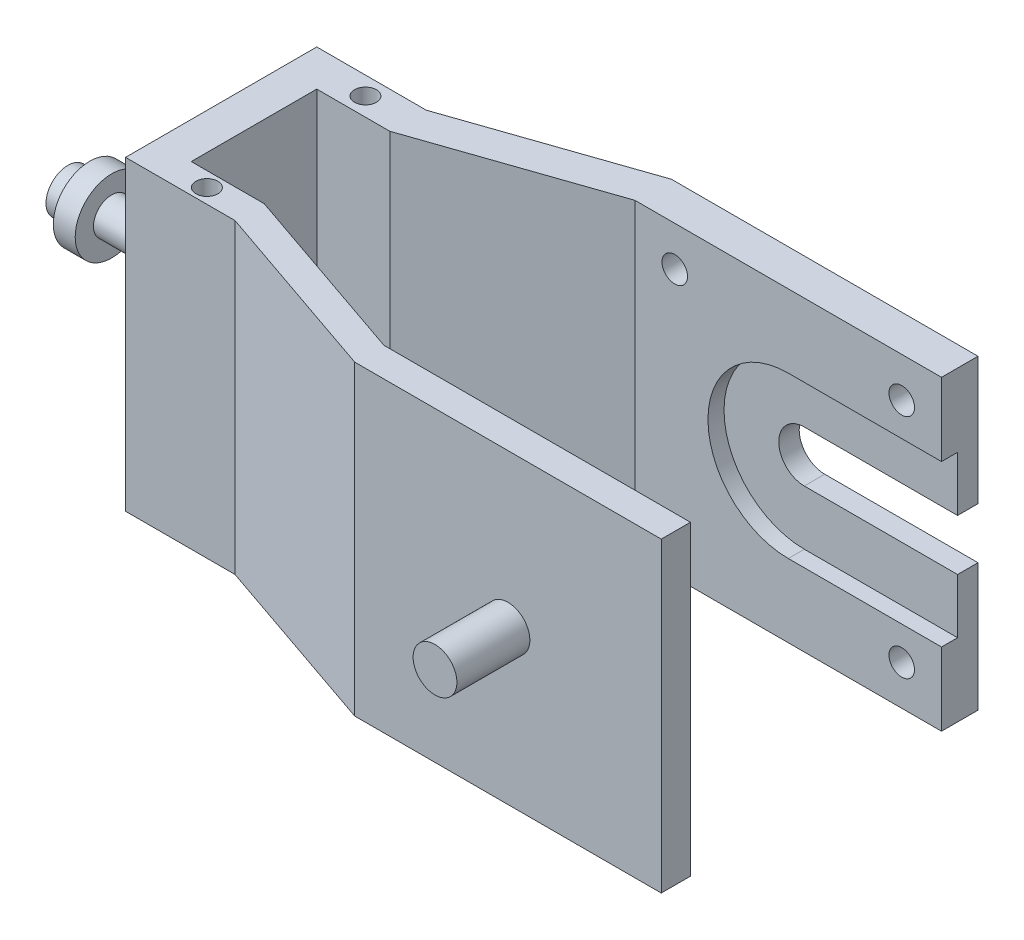
ISO-10303-21;
HEADER;
FILE_DESCRIPTION(('STEP AP214'),'2;1');
FILE_NAME('part.step','',(''),(''),'','','');
FILE_SCHEMA(('AUTOMOTIVE_DESIGN { 1 0 10303 214 1 1 1 1 }'));
ENDSEC;
DATA;
#1=APPLICATION_CONTEXT('core data for automotive mechanical design processes');
#2=APPLICATION_PROTOCOL_DEFINITION('international standard','automotive_design',2000,#1);
#3=PRODUCT_CONTEXT('',#1,'mechanical');
#4=PRODUCT('Part','Part','',(#3));
#5=PRODUCT_RELATED_PRODUCT_CATEGORY('part','',(#4));
#6=PRODUCT_DEFINITION_FORMATION('','',#4);
#7=PRODUCT_DEFINITION_CONTEXT('part definition',#1,'design');
#8=PRODUCT_DEFINITION('design','',#6,#7);
#9=PRODUCT_DEFINITION_SHAPE('','',#8);
#10=(LENGTH_UNIT() NAMED_UNIT(*) SI_UNIT(.MILLI.,.METRE.));
#11=(NAMED_UNIT(*) PLANE_ANGLE_UNIT() SI_UNIT($,.RADIAN.));
#12=(NAMED_UNIT(*) SI_UNIT($,.STERADIAN.) SOLID_ANGLE_UNIT());
#13=UNCERTAINTY_MEASURE_WITH_UNIT(LENGTH_MEASURE(1.E-05),#10,'distance_accuracy_value','');
#14=(GEOMETRIC_REPRESENTATION_CONTEXT(3) GLOBAL_UNCERTAINTY_ASSIGNED_CONTEXT((#13)) GLOBAL_UNIT_ASSIGNED_CONTEXT((#10,
#11,#12)) REPRESENTATION_CONTEXT('',''));
#15=CARTESIAN_POINT('',(0.,0.,0.));
#16=DIRECTION('',(0.,0.,1.));
#17=DIRECTION('',(1.,0.,0.));
#18=AXIS2_PLACEMENT_3D('',#15,#16,#17);
#19=CARTESIAN_POINT('',(0.,42.,-17.2));
#20=DIRECTION('',(-1.,0.,0.));
#21=DIRECTION('',(0.,0.,1.));
#22=AXIS2_PLACEMENT_3D('',#19,#20,#21);
#23=PLANE('',#22);
#24=DIRECTION('',(0.,1.,0.));
#25=VECTOR('',#24,1.);
#26=CARTESIAN_POINT('',(0.,10.,-19.4));
#27=LINE('',#26,#25);
#28=CARTESIAN_POINT('',(0.,24.5,-19.4));
#29=VERTEX_POINT('',#28);
#30=CARTESIAN_POINT('',(0.,32.,-19.4));
#31=VERTEX_POINT('',#30);
#32=EDGE_CURVE('E454',#29,#31,#27,.T.);
#33=ORIENTED_EDGE('',*,*,#32,.F.);
#34=DIRECTION('',(0.,0.,1.));
#35=VECTOR('',#34,1.);
#36=CARTESIAN_POINT('',(0.,24.5,-47.6803846124818));
#37=LINE('',#36,#35);
#38=CARTESIAN_POINT('',(0.,24.5,-22.2));
#39=VERTEX_POINT('',#38);
#40=EDGE_CURVE('E211',#39,#29,#37,.T.);
#41=ORIENTED_EDGE('',*,*,#40,.F.);
#42=DIRECTION('',(0.,-1.,0.));
#43=VECTOR('',#42,1.);
#44=CARTESIAN_POINT('',(0.,42.,-22.2));
#45=LINE('',#44,#43);
#46=CARTESIAN_POINT('',(0.,42.,-22.2));
#47=VERTEX_POINT('',#46);
#48=EDGE_CURVE('E228',#47,#39,#45,.T.);
#49=ORIENTED_EDGE('',*,*,#48,.F.);
#50=DIRECTION('',(0.,0.,-1.));
#51=VECTOR('',#50,1.);
#52=CARTESIAN_POINT('',(0.,42.,-17.2));
#53=LINE('',#52,#51);
#54=CARTESIAN_POINT('',(0.,42.,-17.2));
#55=VERTEX_POINT('',#54);
#56=EDGE_CURVE('E400',#55,#47,#53,.T.);
#57=ORIENTED_EDGE('',*,*,#56,.F.);
#58=DIRECTION('',(0.,-1.,0.));
#59=VECTOR('',#58,1.);
#60=CARTESIAN_POINT('',(0.,42.,-17.2));
#61=LINE('',#60,#59);
#62=CARTESIAN_POINT('',(0.,32.,-17.2));
#63=VERTEX_POINT('',#62);
#64=EDGE_CURVE('E235',#55,#63,#61,.T.);
#65=ORIENTED_EDGE('',*,*,#64,.T.);
#66=DIRECTION('',(0.,0.,1.));
#67=VECTOR('',#66,1.);
#68=CARTESIAN_POINT('',(0.,32.,-19.4));
#69=LINE('',#68,#67);
#70=EDGE_CURVE('E466',#31,#63,#69,.T.);
#71=ORIENTED_EDGE('',*,*,#70,.F.);
#72=EDGE_LOOP('',(#33,#41,#49,#57,#65,#71));
#73=FACE_BOUND('',#72,.T.);
#74=ADVANCED_FACE('F40',(#73),#23,.F.);
#75=CARTESIAN_POINT('',(0.,42.,-17.2));
#76=DIRECTION('',(0.,0.,1.));
#77=DIRECTION('',(1.,0.,0.));
#78=AXIS2_PLACEMENT_3D('',#75,#76,#77);
#79=PLANE('',#78);
#80=CARTESIAN_POINT('',(-5.45,5.45,-17.2));
#81=DIRECTION('',(0.,0.,1.));
#82=DIRECTION('',(1.,0.,0.));
#83=AXIS2_PLACEMENT_3D('',#80,#81,#82);
#84=CIRCLE('',#83,1.75);
#85=CARTESIAN_POINT('',(-3.7,5.45,-17.2));
#86=VERTEX_POINT('',#85);
#87=EDGE_CURVE('E562',#86,#86,#84,.F.);
#88=ORIENTED_EDGE('',*,*,#87,.T.);
#89=EDGE_LOOP('',(#88));
#90=FACE_BOUND('',#89,.T.);
#91=CARTESIAN_POINT('',(-36.55,36.55,-17.2));
#92=DIRECTION('',(0.,0.,1.));
#93=DIRECTION('',(1.,0.,0.));
#94=AXIS2_PLACEMENT_3D('',#91,#92,#93);
#95=CIRCLE('',#94,1.75);
#96=CARTESIAN_POINT('',(-34.8,36.55,-17.2));
#97=VERTEX_POINT('',#96);
#98=EDGE_CURVE('E566',#97,#97,#95,.F.);
#99=ORIENTED_EDGE('',*,*,#98,.T.);
#100=EDGE_LOOP('',(#99));
#101=FACE_BOUND('',#100,.T.);
#102=CARTESIAN_POINT('',(-5.45,36.55,-17.2));
#103=DIRECTION('',(0.,0.,1.));
#104=DIRECTION('',(1.,0.,0.));
#105=AXIS2_PLACEMENT_3D('',#102,#103,#104);
#106=CIRCLE('',#105,1.75);
#107=CARTESIAN_POINT('',(-3.7,36.55,-17.2));
#108=VERTEX_POINT('',#107);
#109=EDGE_CURVE('E572',#108,#108,#106,.F.);
#110=ORIENTED_EDGE('',*,*,#109,.T.);
#111=EDGE_LOOP('',(#110));
#112=FACE_BOUND('',#111,.T.);
#113=CARTESIAN_POINT('',(-36.55,5.45,-17.2));
#114=DIRECTION('',(0.,0.,1.));
#115=DIRECTION('',(1.,0.,0.));
#116=AXIS2_PLACEMENT_3D('',#113,#114,#115);
#117=CIRCLE('',#116,1.75);
#118=CARTESIAN_POINT('',(-34.8,5.45,-17.2));
#119=VERTEX_POINT('',#118);
#120=EDGE_CURVE('E446',#119,#119,#117,.F.);
#121=ORIENTED_EDGE('',*,*,#120,.T.);
#122=EDGE_LOOP('',(#121));
#123=FACE_BOUND('',#122,.T.);
#124=CARTESIAN_POINT('',(-21.,21.,-17.2));
#125=DIRECTION('',(0.,0.,1.));
#126=DIRECTION('',(1.,0.,0.));
#127=AXIS2_PLACEMENT_3D('',#124,#125,#126);
#128=CIRCLE('',#127,11.);
#129=CARTESIAN_POINT('',(-21.,32.,-17.2));
#130=VERTEX_POINT('',#129);
#131=CARTESIAN_POINT('',(-21.,10.,-17.2));
#132=VERTEX_POINT('',#131);
#133=EDGE_CURVE('E222',#130,#132,#128,.T.);
#134=ORIENTED_EDGE('',*,*,#133,.F.);
#135=DIRECTION('',(1.,0.,0.));
#136=VECTOR('',#135,1.);
#137=CARTESIAN_POINT('',(-21.,32.,-17.2));
#138=LINE('',#137,#136);
#139=EDGE_CURVE('E436',#130,#63,#138,.T.);
#140=ORIENTED_EDGE('',*,*,#139,.T.);
#141=ORIENTED_EDGE('',*,*,#64,.F.);
#142=DIRECTION('',(-1.,0.,0.));
#143=VECTOR('',#142,1.);
#144=CARTESIAN_POINT('',(0.,42.,-17.2));
#145=LINE('',#144,#143);
#146=CARTESIAN_POINT('',(-42.,42.,-17.2));
#147=VERTEX_POINT('',#146);
#148=EDGE_CURVE('E407',#55,#147,#145,.T.);
#149=ORIENTED_EDGE('',*,*,#148,.T.);
#150=DIRECTION('',(0.,-1.,0.));
#151=VECTOR('',#150,1.);
#152=CARTESIAN_POINT('',(-42.,42.,-17.2));
#153=LINE('',#152,#151);
#154=CARTESIAN_POINT('',(-42.,0.,-17.2));
#155=VERTEX_POINT('',#154);
#156=EDGE_CURVE('E312',#147,#155,#153,.T.);
#157=ORIENTED_EDGE('',*,*,#156,.T.);
#158=DIRECTION('',(-1.,0.,0.));
#159=VECTOR('',#158,1.);
#160=CARTESIAN_POINT('',(0.,0.,-17.2));
#161=LINE('',#160,#159);
#162=CARTESIAN_POINT('',(0.,0.,-17.2));
#163=VERTEX_POINT('',#162);
#164=EDGE_CURVE('E327',#163,#155,#161,.T.);
#165=ORIENTED_EDGE('',*,*,#164,.F.);
#166=CARTESIAN_POINT('',(0.,10.,-17.2));
#167=VERTEX_POINT('',#166);
#168=EDGE_CURVE('E231',#167,#163,#61,.T.);
#169=ORIENTED_EDGE('',*,*,#168,.F.);
#170=DIRECTION('',(1.,0.,0.));
#171=VECTOR('',#170,1.);
#172=CARTESIAN_POINT('',(-21.,10.,-17.2));
#173=LINE('',#172,#171);
#174=EDGE_CURVE('E462',#132,#167,#173,.T.);
#175=ORIENTED_EDGE('',*,*,#174,.F.);
#176=EDGE_LOOP('',(#134,#140,#141,#149,#157,#165,#169,#175));
#177=FACE_BOUND('',#176,.T.);
#178=ADVANCED_FACE('F331',(#90,#101,#112,#123,#177),#79,.T.);
#179=CARTESIAN_POINT('',(0.,17.5,-22.2));
#180=VERTEX_POINT('',#179);
#181=CARTESIAN_POINT('',(0.,0.,-22.2));
#182=VERTEX_POINT('',#181);
#183=EDGE_CURVE('E218',#180,#182,#45,.T.);
#184=ORIENTED_EDGE('',*,*,#183,.F.);
#185=DIRECTION('',(0.,0.,1.));
#186=VECTOR('',#185,1.);
#187=CARTESIAN_POINT('',(0.,17.5,-47.6803846124818));
#188=LINE('',#187,#186);
#189=CARTESIAN_POINT('',(0.,17.5,-19.4));
#190=VERTEX_POINT('',#189);
#191=EDGE_CURVE('E202',#180,#190,#188,.T.);
#192=ORIENTED_EDGE('',*,*,#191,.T.);
#193=CARTESIAN_POINT('',(0.,10.,-19.4));
#194=VERTEX_POINT('',#193);
#195=EDGE_CURVE('E455',#194,#190,#27,.T.);
#196=ORIENTED_EDGE('',*,*,#195,.F.);
#197=DIRECTION('',(0.,0.,1.));
#198=VECTOR('',#197,1.);
#199=CARTESIAN_POINT('',(0.,10.,-19.4));
#200=LINE('',#199,#198);
#201=EDGE_CURVE('E323',#194,#167,#200,.T.);
#202=ORIENTED_EDGE('',*,*,#201,.T.);
#203=ORIENTED_EDGE('',*,*,#168,.T.);
#204=DIRECTION('',(0.,0.,-1.));
#205=VECTOR('',#204,1.);
#206=CARTESIAN_POINT('',(0.,0.,-17.2));
#207=LINE('',#206,#205);
#208=EDGE_CURVE('E226',#163,#182,#207,.T.);
#209=ORIENTED_EDGE('',*,*,#208,.T.);
#210=EDGE_LOOP('',(#184,#192,#196,#202,#203,#209));
#211=FACE_BOUND('',#210,.T.);
#212=ADVANCED_FACE('F224',(#211),#23,.F.);
#213=CARTESIAN_POINT('',(-67.,42.,-13.6));
#214=DIRECTION('',(-0.325291181486159,0.,-0.945613899669066));
#215=DIRECTION('',(-0.945613899669066,0.,0.325291181486159));
#216=AXIS2_PLACEMENT_3D('',#213,#214,#215);
#217=PLANE('',#216);
#218=DIRECTION('',(0.945613899669066,0.,-0.325291181486159));
#219=VECTOR('',#218,1.);
#220=CARTESIAN_POINT('',(-67.,0.,-13.6));
#221=LINE('',#220,#219);
#222=CARTESIAN_POINT('',(-67.,0.,-13.6));
#223=VERTEX_POINT('',#222);
#224=CARTESIAN_POINT('',(-42.,0.,-22.2));
#225=VERTEX_POINT('',#224);
#226=EDGE_CURVE('E389',#223,#225,#221,.T.);
#227=ORIENTED_EDGE('',*,*,#226,.F.);
#228=DIRECTION('',(0.,-1.,0.));
#229=VECTOR('',#228,1.);
#230=CARTESIAN_POINT('',(-67.,42.,-13.6));
#231=LINE('',#230,#229);
#232=CARTESIAN_POINT('',(-67.,42.,-13.6));
#233=VERTEX_POINT('',#232);
#234=EDGE_CURVE('E240',#233,#223,#231,.T.);
#235=ORIENTED_EDGE('',*,*,#234,.F.);
#236=DIRECTION('',(0.945613899669066,0.,-0.325291181486159));
#237=VECTOR('',#236,1.);
#238=CARTESIAN_POINT('',(-67.,42.,-13.6));
#239=LINE('',#238,#237);
#240=CARTESIAN_POINT('',(-42.,42.,-22.2));
#241=VERTEX_POINT('',#240);
#242=EDGE_CURVE('E291',#233,#241,#239,.T.);
#243=ORIENTED_EDGE('',*,*,#242,.T.);
#244=DIRECTION('',(0.,-1.,0.));
#245=VECTOR('',#244,1.);
#246=CARTESIAN_POINT('',(-42.,42.,-22.2));
#247=LINE('',#246,#245);
#248=EDGE_CURVE('E229',#241,#225,#247,.T.);
#249=ORIENTED_EDGE('',*,*,#248,.T.);
#250=EDGE_LOOP('',(#227,#235,#243,#249));
#251=FACE_BOUND('',#250,.T.);
#252=ADVANCED_FACE('F42',(#251),#217,.T.);
#253=CARTESIAN_POINT('',(-67.,42.,-13.6));
#254=DIRECTION('',(0.,0.,1.));
#255=DIRECTION('',(1.,0.,0.));
#256=AXIS2_PLACEMENT_3D('',#253,#254,#255);
#257=PLANE('',#256);
#258=DIRECTION('',(-1.,0.,0.));
#259=VECTOR('',#258,1.);
#260=CARTESIAN_POINT('',(-67.,0.,-13.6));
#261=LINE('',#260,#259);
#262=CARTESIAN_POINT('',(-82.,0.,-13.6));
#263=VERTEX_POINT('',#262);
#264=EDGE_CURVE('E270',#223,#263,#261,.T.);
#265=ORIENTED_EDGE('',*,*,#264,.T.);
#266=DIRECTION('',(0.,-1.,0.));
#267=VECTOR('',#266,1.);
#268=CARTESIAN_POINT('',(-82.,42.,-13.6));
#269=LINE('',#268,#267);
#270=CARTESIAN_POINT('',(-82.,42.,-13.6));
#271=VERTEX_POINT('',#270);
#272=EDGE_CURVE('E266',#271,#263,#269,.T.);
#273=ORIENTED_EDGE('',*,*,#272,.F.);
#274=DIRECTION('',(-1.,0.,0.));
#275=VECTOR('',#274,1.);
#276=CARTESIAN_POINT('',(-67.,42.,-13.6));
#277=LINE('',#276,#275);
#278=EDGE_CURVE('E232',#233,#271,#277,.T.);
#279=ORIENTED_EDGE('',*,*,#278,.F.);
#280=ORIENTED_EDGE('',*,*,#234,.T.);
#281=EDGE_LOOP('',(#265,#273,#279,#280));
#282=FACE_BOUND('',#281,.T.);
#283=ADVANCED_FACE('F255',(#282),#257,.F.);
#284=CARTESIAN_POINT('',(-82.,42.,-13.6));
#285=DIRECTION('',(1.,0.,0.));
#286=DIRECTION('',(0.,0.,-1.));
#287=AXIS2_PLACEMENT_3D('',#284,#285,#286);
#288=PLANE('',#287);
#289=CARTESIAN_POINT('',(-82.,21.,-0.499999999999994));
#290=DIRECTION('',(1.,0.,0.));
#291=DIRECTION('',(0.,0.,-1.));
#292=AXIS2_PLACEMENT_3D('',#289,#290,#291);
#293=CIRCLE('',#292,2.5);
#294=CARTESIAN_POINT('',(-82.,21.,-2.99999999999999));
#295=VERTEX_POINT('',#294);
#296=EDGE_CURVE('E44',#295,#295,#293,.F.);
#297=ORIENTED_EDGE('',*,*,#296,.F.);
#298=EDGE_LOOP('',(#297));
#299=FACE_BOUND('',#298,.T.);
#300=DIRECTION('',(0.,0.,1.));
#301=VECTOR('',#300,1.);
#302=CARTESIAN_POINT('',(-82.,0.,-13.6));
#303=LINE('',#302,#301);
#304=CARTESIAN_POINT('',(-82.,0.,12.6));
#305=VERTEX_POINT('',#304);
#306=EDGE_CURVE('E260',#263,#305,#303,.T.);
#307=ORIENTED_EDGE('',*,*,#306,.T.);
#308=DIRECTION('',(0.,-1.,0.));
#309=VECTOR('',#308,1.);
#310=CARTESIAN_POINT('',(-82.,42.,12.6));
#311=LINE('',#310,#309);
#312=CARTESIAN_POINT('',(-82.,42.,12.6));
#313=VERTEX_POINT('',#312);
#314=EDGE_CURVE('E263',#313,#305,#311,.T.);
#315=ORIENTED_EDGE('',*,*,#314,.F.);
#316=DIRECTION('',(0.,0.,1.));
#317=VECTOR('',#316,1.);
#318=CARTESIAN_POINT('',(-82.,42.,-13.6));
#319=LINE('',#318,#317);
#320=EDGE_CURVE('E386',#271,#313,#319,.T.);
#321=ORIENTED_EDGE('',*,*,#320,.F.);
#322=ORIENTED_EDGE('',*,*,#272,.T.);
#323=EDGE_LOOP('',(#307,#315,#321,#322));
#324=FACE_BOUND('',#323,.T.);
#325=ADVANCED_FACE('F251',(#299,#324),#288,.F.);
#326=CARTESIAN_POINT('',(-82.,42.,12.6));
#327=DIRECTION('',(0.,0.,-1.));
#328=DIRECTION('',(-1.,0.,0.));
#329=AXIS2_PLACEMENT_3D('',#326,#327,#328);
#330=PLANE('',#329);
#331=DIRECTION('',(1.,0.,0.));
#332=VECTOR('',#331,1.);
#333=CARTESIAN_POINT('',(-82.,0.,12.6));
#334=LINE('',#333,#332);
#335=CARTESIAN_POINT('',(-67.,0.,12.6));
#336=VERTEX_POINT('',#335);
#337=EDGE_CURVE('E271',#305,#336,#334,.T.);
#338=ORIENTED_EDGE('',*,*,#337,.T.);
#339=DIRECTION('',(0.,-1.,0.));
#340=VECTOR('',#339,1.);
#341=CARTESIAN_POINT('',(-67.,42.,12.6));
#342=LINE('',#341,#340);
#343=CARTESIAN_POINT('',(-67.,42.,12.6));
#344=VERTEX_POINT('',#343);
#345=EDGE_CURVE('E278',#344,#336,#342,.T.);
#346=ORIENTED_EDGE('',*,*,#345,.F.);
#347=DIRECTION('',(1.,0.,0.));
#348=VECTOR('',#347,1.);
#349=CARTESIAN_POINT('',(-82.,42.,12.6));
#350=LINE('',#349,#348);
#351=EDGE_CURVE('E277',#313,#344,#350,.T.);
#352=ORIENTED_EDGE('',*,*,#351,.F.);
#353=ORIENTED_EDGE('',*,*,#314,.T.);
#354=EDGE_LOOP('',(#338,#346,#352,#353));
#355=FACE_BOUND('',#354,.T.);
#356=ADVANCED_FACE('F254',(#355),#330,.F.);
#357=CARTESIAN_POINT('',(-42.,42.,21.2));
#358=DIRECTION('',(-0.325291181486158,0.,0.945613899669066));
#359=DIRECTION('',(0.945613899669066,0.,0.325291181486158));
#360=AXIS2_PLACEMENT_3D('',#357,#358,#359);
#361=PLANE('',#360);
#362=DIRECTION('',(-0.945613899669066,0.,-0.325291181486158));
#363=VECTOR('',#362,1.);
#364=CARTESIAN_POINT('',(-42.,0.,21.2));
#365=LINE('',#364,#363);
#366=CARTESIAN_POINT('',(-42.,0.,21.2));
#367=VERTEX_POINT('',#366);
#368=EDGE_CURVE('E284',#367,#336,#365,.T.);
#369=ORIENTED_EDGE('',*,*,#368,.F.);
#370=DIRECTION('',(0.,-1.,0.));
#371=VECTOR('',#370,1.);
#372=CARTESIAN_POINT('',(-42.,42.,21.2));
#373=LINE('',#372,#371);
#374=CARTESIAN_POINT('',(-42.,42.,21.2));
#375=VERTEX_POINT('',#374);
#376=EDGE_CURVE('E295',#375,#367,#373,.T.);
#377=ORIENTED_EDGE('',*,*,#376,.F.);
#378=DIRECTION('',(-0.945613899669066,0.,-0.325291181486158));
#379=VECTOR('',#378,1.);
#380=CARTESIAN_POINT('',(-42.,42.,21.2));
#381=LINE('',#380,#379);
#382=EDGE_CURVE('E382',#375,#344,#381,.T.);
#383=ORIENTED_EDGE('',*,*,#382,.T.);
#384=ORIENTED_EDGE('',*,*,#345,.T.);
#385=EDGE_LOOP('',(#369,#377,#383,#384));
#386=FACE_BOUND('',#385,.T.);
#387=ADVANCED_FACE('F513',(#386),#361,.T.);
#388=CARTESIAN_POINT('',(-42.,42.,21.2));
#389=DIRECTION('',(0.,0.,-1.));
#390=DIRECTION('',(-1.,0.,0.));
#391=AXIS2_PLACEMENT_3D('',#388,#389,#390);
#392=PLANE('',#391);
#393=CARTESIAN_POINT('',(-21.,21.,21.2));
#394=DIRECTION('',(0.,0.,-1.));
#395=DIRECTION('',(-1.,0.,0.));
#396=AXIS2_PLACEMENT_3D('',#393,#394,#395);
#397=CIRCLE('',#396,3.);
#398=CARTESIAN_POINT('',(-24.,21.,21.2));
#399=VERTEX_POINT('',#398);
#400=EDGE_CURVE('E578',#399,#399,#397,.T.);
#401=ORIENTED_EDGE('',*,*,#400,.T.);
#402=EDGE_LOOP('',(#401));
#403=FACE_BOUND('',#402,.T.);
#404=DIRECTION('',(1.,0.,0.));
#405=VECTOR('',#404,1.);
#406=CARTESIAN_POINT('',(-42.,0.,21.2));
#407=LINE('',#406,#405);
#408=CARTESIAN_POINT('',(0.,0.,21.2));
#409=VERTEX_POINT('',#408);
#410=EDGE_CURVE('E286',#367,#409,#407,.T.);
#411=ORIENTED_EDGE('',*,*,#410,.T.);
#412=DIRECTION('',(0.,-1.,0.));
#413=VECTOR('',#412,1.);
#414=CARTESIAN_POINT('',(0.,42.,21.2));
#415=LINE('',#414,#413);
#416=CARTESIAN_POINT('',(0.,42.,21.2));
#417=VERTEX_POINT('',#416);
#418=EDGE_CURVE('E297',#417,#409,#415,.T.);
#419=ORIENTED_EDGE('',*,*,#418,.F.);
#420=DIRECTION('',(1.,0.,0.));
#421=VECTOR('',#420,1.);
#422=CARTESIAN_POINT('',(-42.,42.,21.2));
#423=LINE('',#422,#421);
#424=EDGE_CURVE('E375',#375,#417,#423,.T.);
#425=ORIENTED_EDGE('',*,*,#424,.F.);
#426=ORIENTED_EDGE('',*,*,#376,.T.);
#427=EDGE_LOOP('',(#411,#419,#425,#426));
#428=FACE_BOUND('',#427,.T.);
#429=ADVANCED_FACE('F355',(#403,#428),#392,.F.);
#430=CARTESIAN_POINT('',(0.,42.,21.2));
#431=DIRECTION('',(-1.,0.,0.));
#432=DIRECTION('',(0.,0.,1.));
#433=AXIS2_PLACEMENT_3D('',#430,#431,#432);
#434=PLANE('',#433);
#435=DIRECTION('',(0.,0.,-1.));
#436=VECTOR('',#435,1.);
#437=CARTESIAN_POINT('',(0.,0.,21.2));
#438=LINE('',#437,#436);
#439=CARTESIAN_POINT('',(0.,0.,17.2));
#440=VERTEX_POINT('',#439);
#441=EDGE_CURVE('E352',#409,#440,#438,.T.);
#442=ORIENTED_EDGE('',*,*,#441,.T.);
#443=DIRECTION('',(0.,-1.,0.));
#444=VECTOR('',#443,1.);
#445=CARTESIAN_POINT('',(0.,42.,17.2));
#446=LINE('',#445,#444);
#447=CARTESIAN_POINT('',(0.,42.,17.2));
#448=VERTEX_POINT('',#447);
#449=EDGE_CURVE('E300',#448,#440,#446,.T.);
#450=ORIENTED_EDGE('',*,*,#449,.F.);
#451=DIRECTION('',(0.,0.,-1.));
#452=VECTOR('',#451,1.);
#453=CARTESIAN_POINT('',(0.,42.,21.2));
#454=LINE('',#453,#452);
#455=EDGE_CURVE('E362',#417,#448,#454,.T.);
#456=ORIENTED_EDGE('',*,*,#455,.F.);
#457=ORIENTED_EDGE('',*,*,#418,.T.);
#458=EDGE_LOOP('',(#442,#450,#456,#457));
#459=FACE_BOUND('',#458,.T.);
#460=ADVANCED_FACE('F360',(#459),#434,.F.);
#461=CARTESIAN_POINT('',(0.,42.,17.2));
#462=DIRECTION('',(0.,0.,1.));
#463=DIRECTION('',(1.,0.,0.));
#464=AXIS2_PLACEMENT_3D('',#461,#462,#463);
#465=PLANE('',#464);
#466=DIRECTION('',(-1.,0.,0.));
#467=VECTOR('',#466,1.);
#468=CARTESIAN_POINT('',(0.,0.,17.2));
#469=LINE('',#468,#467);
#470=CARTESIAN_POINT('',(-42.,0.,17.2));
#471=VERTEX_POINT('',#470);
#472=EDGE_CURVE('E349',#440,#471,#469,.T.);
#473=ORIENTED_EDGE('',*,*,#472,.T.);
#474=DIRECTION('',(0.,-1.,0.));
#475=VECTOR('',#474,1.);
#476=CARTESIAN_POINT('',(-42.,42.,17.2));
#477=LINE('',#476,#475);
#478=CARTESIAN_POINT('',(-42.,42.,17.2));
#479=VERTEX_POINT('',#478);
#480=EDGE_CURVE('E303',#479,#471,#477,.T.);
#481=ORIENTED_EDGE('',*,*,#480,.F.);
#482=DIRECTION('',(-1.,0.,0.));
#483=VECTOR('',#482,1.);
#484=CARTESIAN_POINT('',(0.,42.,17.2));
#485=LINE('',#484,#483);
#486=EDGE_CURVE('E370',#448,#479,#485,.T.);
#487=ORIENTED_EDGE('',*,*,#486,.F.);
#488=ORIENTED_EDGE('',*,*,#449,.T.);
#489=EDGE_LOOP('',(#473,#481,#487,#488));
#490=FACE_BOUND('',#489,.T.);
#491=ADVANCED_FACE('F367',(#490),#465,.F.);
#492=CARTESIAN_POINT('',(-67.,42.,8.60000000000001));
#493=DIRECTION('',(0.325291181486158,0.,-0.945613899669067));
#494=DIRECTION('',(-0.945613899669067,0.,-0.325291181486158));
#495=AXIS2_PLACEMENT_3D('',#492,#493,#494);
#496=PLANE('',#495);
#497=DIRECTION('',(0.945613899669066,0.,0.325291181486158));
#498=VECTOR('',#497,1.);
#499=CARTESIAN_POINT('',(-67.,0.,8.60000000000001));
#500=LINE('',#499,#498);
#501=CARTESIAN_POINT('',(-67.,0.,8.60000000000001));
#502=VERTEX_POINT('',#501);
#503=EDGE_CURVE('E346',#502,#471,#500,.T.);
#504=ORIENTED_EDGE('',*,*,#503,.F.);
#505=DIRECTION('',(0.,-1.,0.));
#506=VECTOR('',#505,1.);
#507=CARTESIAN_POINT('',(-67.,42.,8.60000000000001));
#508=LINE('',#507,#506);
#509=CARTESIAN_POINT('',(-67.,42.,8.60000000000001));
#510=VERTEX_POINT('',#509);
#511=EDGE_CURVE('E305',#510,#502,#508,.T.);
#512=ORIENTED_EDGE('',*,*,#511,.F.);
#513=DIRECTION('',(0.945613899669066,0.,0.325291181486158));
#514=VECTOR('',#513,1.);
#515=CARTESIAN_POINT('',(-67.,42.,8.60000000000001));
#516=LINE('',#515,#514);
#517=EDGE_CURVE('E373',#510,#479,#516,.T.);
#518=ORIENTED_EDGE('',*,*,#517,.T.);
#519=ORIENTED_EDGE('',*,*,#480,.T.);
#520=EDGE_LOOP('',(#504,#512,#518,#519));
#521=FACE_BOUND('',#520,.T.);
#522=ADVANCED_FACE('F524',(#521),#496,.T.);
#523=CARTESIAN_POINT('',(-77.,42.,8.60000000000001));
#524=DIRECTION('',(0.,0.,-1.));
#525=DIRECTION('',(-1.,0.,0.));
#526=AXIS2_PLACEMENT_3D('',#523,#524,#525);
#527=PLANE('',#526);
#528=DIRECTION('',(1.,0.,0.));
#529=VECTOR('',#528,1.);
#530=CARTESIAN_POINT('',(-77.,0.,8.60000000000001));
#531=LINE('',#530,#529);
#532=CARTESIAN_POINT('',(-77.,0.,8.60000000000001));
#533=VERTEX_POINT('',#532);
#534=EDGE_CURVE('E343',#533,#502,#531,.T.);
#535=ORIENTED_EDGE('',*,*,#534,.F.);
#536=DIRECTION('',(0.,-1.,0.));
#537=VECTOR('',#536,1.);
#538=CARTESIAN_POINT('',(-77.,42.,8.60000000000001));
#539=LINE('',#538,#537);
#540=CARTESIAN_POINT('',(-77.,42.,8.60000000000001));
#541=VERTEX_POINT('',#540);
#542=EDGE_CURVE('E307',#541,#533,#539,.T.);
#543=ORIENTED_EDGE('',*,*,#542,.F.);
#544=DIRECTION('',(1.,0.,0.));
#545=VECTOR('',#544,1.);
#546=CARTESIAN_POINT('',(-77.,42.,8.60000000000001));
#547=LINE('',#546,#545);
#548=EDGE_CURVE('E377',#541,#510,#547,.T.);
#549=ORIENTED_EDGE('',*,*,#548,.T.);
#550=ORIENTED_EDGE('',*,*,#511,.T.);
#551=EDGE_LOOP('',(#535,#543,#549,#550));
#552=FACE_BOUND('',#551,.T.);
#553=ADVANCED_FACE('F420',(#552),#527,.T.);
#554=CARTESIAN_POINT('',(-77.,42.,-8.59999999999999));
#555=DIRECTION('',(1.,0.,0.));
#556=DIRECTION('',(0.,0.,-1.));
#557=AXIS2_PLACEMENT_3D('',#554,#555,#556);
#558=PLANE('',#557);
#559=DIRECTION('',(0.,0.,1.));
#560=VECTOR('',#559,1.);
#561=CARTESIAN_POINT('',(-77.,0.,-8.59999999999999));
#562=LINE('',#561,#560);
#563=CARTESIAN_POINT('',(-77.,0.,-8.59999999999999));
#564=VERTEX_POINT('',#563);
#565=EDGE_CURVE('E340',#564,#533,#562,.T.);
#566=ORIENTED_EDGE('',*,*,#565,.F.);
#567=DIRECTION('',(0.,-1.,0.));
#568=VECTOR('',#567,1.);
#569=CARTESIAN_POINT('',(-77.,42.,-8.59999999999999));
#570=LINE('',#569,#568);
#571=CARTESIAN_POINT('',(-77.,42.,-8.59999999999999));
#572=VERTEX_POINT('',#571);
#573=EDGE_CURVE('E309',#572,#564,#570,.T.);
#574=ORIENTED_EDGE('',*,*,#573,.F.);
#575=DIRECTION('',(0.,0.,1.));
#576=VECTOR('',#575,1.);
#577=CARTESIAN_POINT('',(-77.,42.,-8.59999999999999));
#578=LINE('',#577,#576);
#579=EDGE_CURVE('E414',#572,#541,#578,.T.);
#580=ORIENTED_EDGE('',*,*,#579,.T.);
#581=ORIENTED_EDGE('',*,*,#542,.T.);
#582=EDGE_LOOP('',(#566,#574,#580,#581));
#583=FACE_BOUND('',#582,.T.);
#584=ADVANCED_FACE('F425',(#583),#558,.T.);
#585=CARTESIAN_POINT('',(-77.,42.,-8.59999999999999));
#586=DIRECTION('',(0.,0.,-1.));
#587=DIRECTION('',(-1.,0.,0.));
#588=AXIS2_PLACEMENT_3D('',#585,#586,#587);
#589=PLANE('',#588);
#590=DIRECTION('',(1.,0.,0.));
#591=VECTOR('',#590,1.);
#592=CARTESIAN_POINT('',(-77.,0.,-8.59999999999999));
#593=LINE('',#592,#591);
#594=CARTESIAN_POINT('',(-67.,0.,-8.59999999999999));
#595=VERTEX_POINT('',#594);
#596=EDGE_CURVE('E334',#564,#595,#593,.T.);
#597=ORIENTED_EDGE('',*,*,#596,.T.);
#598=DIRECTION('',(0.,-1.,0.));
#599=VECTOR('',#598,1.);
#600=CARTESIAN_POINT('',(-67.,42.,-8.59999999999999));
#601=LINE('',#600,#599);
#602=CARTESIAN_POINT('',(-67.,42.,-8.59999999999999));
#603=VERTEX_POINT('',#602);
#604=EDGE_CURVE('E311',#603,#595,#601,.T.);
#605=ORIENTED_EDGE('',*,*,#604,.F.);
#606=DIRECTION('',(1.,0.,0.));
#607=VECTOR('',#606,1.);
#608=CARTESIAN_POINT('',(-77.,42.,-8.59999999999999));
#609=LINE('',#608,#607);
#610=EDGE_CURVE('E412',#572,#603,#609,.T.);
#611=ORIENTED_EDGE('',*,*,#610,.F.);
#612=ORIENTED_EDGE('',*,*,#573,.T.);
#613=EDGE_LOOP('',(#597,#605,#611,#612));
#614=FACE_BOUND('',#613,.T.);
#615=ADVANCED_FACE('F430',(#614),#589,.F.);
#616=CARTESIAN_POINT('',(-42.,42.,-17.2));
#617=DIRECTION('',(0.325291181486159,0.,0.945613899669066));
#618=DIRECTION('',(0.945613899669066,0.,-0.325291181486159));
#619=AXIS2_PLACEMENT_3D('',#616,#617,#618);
#620=PLANE('',#619);
#621=DIRECTION('',(-0.945613899669066,0.,0.325291181486159));
#622=VECTOR('',#621,1.);
#623=CARTESIAN_POINT('',(-42.,0.,-17.2));
#624=LINE('',#623,#622);
#625=EDGE_CURVE('E332',#155,#595,#624,.T.);
#626=ORIENTED_EDGE('',*,*,#625,.F.);
#627=ORIENTED_EDGE('',*,*,#156,.F.);
#628=DIRECTION('',(-0.945613899669066,0.,0.325291181486159));
#629=VECTOR('',#628,1.);
#630=CARTESIAN_POINT('',(-42.,42.,-17.2));
#631=LINE('',#630,#629);
#632=EDGE_CURVE('E409',#147,#603,#631,.T.);
#633=ORIENTED_EDGE('',*,*,#632,.T.);
#634=ORIENTED_EDGE('',*,*,#604,.T.);
#635=EDGE_LOOP('',(#626,#627,#633,#634));
#636=FACE_BOUND('',#635,.T.);
#637=ADVANCED_FACE('F534',(#636),#620,.T.);
#638=CARTESIAN_POINT('',(0.,42.,-22.2));
#639=DIRECTION('',(0.,0.,1.));
#640=DIRECTION('',(1.,0.,0.));
#641=AXIS2_PLACEMENT_3D('',#638,#639,#640);
#642=PLANE('',#641);
#643=CARTESIAN_POINT('',(-5.45,5.45,-22.2));
#644=DIRECTION('',(0.,0.,-1.));
#645=DIRECTION('',(-1.,0.,0.));
#646=AXIS2_PLACEMENT_3D('',#643,#644,#645);
#647=CIRCLE('',#646,1.75);
#648=CARTESIAN_POINT('',(-7.2,5.45,-22.2));
#649=VERTEX_POINT('',#648);
#650=EDGE_CURVE('E548',#649,#649,#647,.T.);
#651=ORIENTED_EDGE('',*,*,#650,.F.);
#652=EDGE_LOOP('',(#651));
#653=FACE_BOUND('',#652,.T.);
#654=CARTESIAN_POINT('',(-36.55,36.55,-22.2));
#655=DIRECTION('',(0.,0.,-1.));
#656=DIRECTION('',(-1.,0.,0.));
#657=AXIS2_PLACEMENT_3D('',#654,#655,#656);
#658=CIRCLE('',#657,1.75);
#659=CARTESIAN_POINT('',(-38.3,36.55,-22.2));
#660=VERTEX_POINT('',#659);
#661=EDGE_CURVE('E552',#660,#660,#658,.T.);
#662=ORIENTED_EDGE('',*,*,#661,.F.);
#663=EDGE_LOOP('',(#662));
#664=FACE_BOUND('',#663,.T.);
#665=CARTESIAN_POINT('',(-5.45,36.55,-22.2));
#666=DIRECTION('',(0.,0.,-1.));
#667=DIRECTION('',(-1.,0.,0.));
#668=AXIS2_PLACEMENT_3D('',#665,#666,#667);
#669=CIRCLE('',#668,1.75);
#670=CARTESIAN_POINT('',(-7.2,36.55,-22.2));
#671=VERTEX_POINT('',#670);
#672=EDGE_CURVE('E556',#671,#671,#669,.T.);
#673=ORIENTED_EDGE('',*,*,#672,.F.);
#674=EDGE_LOOP('',(#673));
#675=FACE_BOUND('',#674,.T.);
#676=CARTESIAN_POINT('',(-36.55,5.45,-22.2));
#677=DIRECTION('',(0.,0.,-1.));
#678=DIRECTION('',(-1.,0.,0.));
#679=AXIS2_PLACEMENT_3D('',#676,#677,#678);
#680=CIRCLE('',#679,1.75);
#681=CARTESIAN_POINT('',(-38.3,5.45,-22.2));
#682=VERTEX_POINT('',#681);
#683=EDGE_CURVE('E559',#682,#682,#680,.T.);
#684=ORIENTED_EDGE('',*,*,#683,.F.);
#685=EDGE_LOOP('',(#684));
#686=FACE_BOUND('',#685,.T.);
#687=ORIENTED_EDGE('',*,*,#48,.T.);
#688=DIRECTION('',(1.,0.,0.));
#689=VECTOR('',#688,1.);
#690=CARTESIAN_POINT('',(-21.,24.5,-22.2));
#691=LINE('',#690,#689);
#692=CARTESIAN_POINT('',(-21.,24.5,-22.2));
#693=VERTEX_POINT('',#692);
#694=EDGE_CURVE('E440',#693,#39,#691,.T.);
#695=ORIENTED_EDGE('',*,*,#694,.F.);
#696=CARTESIAN_POINT('',(-21.,21.,-22.2));
#697=DIRECTION('',(0.,0.,1.));
#698=DIRECTION('',(1.,0.,0.));
#699=AXIS2_PLACEMENT_3D('',#696,#697,#698);
#700=CIRCLE('',#699,3.5);
#701=CARTESIAN_POINT('',(-21.,17.5,-22.2));
#702=VERTEX_POINT('',#701);
#703=EDGE_CURVE('E221',#702,#693,#700,.F.);
#704=ORIENTED_EDGE('',*,*,#703,.F.);
#705=DIRECTION('',(-1.,0.,0.));
#706=VECTOR('',#705,1.);
#707=CARTESIAN_POINT('',(0.,17.5,-22.2));
#708=LINE('',#707,#706);
#709=EDGE_CURVE('E205',#180,#702,#708,.T.);
#710=ORIENTED_EDGE('',*,*,#709,.F.);
#711=ORIENTED_EDGE('',*,*,#183,.T.);
#712=DIRECTION('',(-1.,0.,0.));
#713=VECTOR('',#712,1.);
#714=CARTESIAN_POINT('',(0.,0.,-22.2));
#715=LINE('',#714,#713);
#716=EDGE_CURVE('E328',#182,#225,#715,.T.);
#717=ORIENTED_EDGE('',*,*,#716,.T.);
#718=ORIENTED_EDGE('',*,*,#248,.F.);
#719=DIRECTION('',(-1.,0.,0.));
#720=VECTOR('',#719,1.);
#721=CARTESIAN_POINT('',(0.,42.,-22.2));
#722=LINE('',#721,#720);
#723=EDGE_CURVE('E398',#47,#241,#722,.T.);
#724=ORIENTED_EDGE('',*,*,#723,.F.);
#725=EDGE_LOOP('',(#687,#695,#704,#710,#711,#717,#718,#724));
#726=FACE_BOUND('',#725,.T.);
#727=ADVANCED_FACE('F216',(#653,#664,#675,#686,#726),#642,.F.);
#728=CARTESIAN_POINT('',(0.,42.,0.));
#729=DIRECTION('',(0.,1.,0.));
#730=DIRECTION('',(0.,0.,1.));
#731=AXIS2_PLACEMENT_3D('',#728,#729,#730);
#732=PLANE('',#731);
#733=CARTESIAN_POINT('',(-72.8457494122717,42.,10.6072526870788));
#734=DIRECTION('',(0.,1.,0.));
#735=DIRECTION('',(0.,0.,1.));
#736=AXIS2_PLACEMENT_3D('',#733,#734,#735);
#737=CIRCLE('',#736,1.5);
#738=CARTESIAN_POINT('',(-72.8457494122717,42.,12.1072526870788));
#739=VERTEX_POINT('',#738);
#740=EDGE_CURVE('E592',#739,#739,#737,.T.);
#741=ORIENTED_EDGE('',*,*,#740,.F.);
#742=EDGE_LOOP('',(#741));
#743=FACE_BOUND('',#742,.T.);
#744=CARTESIAN_POINT('',(-72.8457494122717,42.,-11.1143007265442));
#745=DIRECTION('',(0.,1.,0.));
#746=DIRECTION('',(0.,0.,1.));
#747=AXIS2_PLACEMENT_3D('',#744,#745,#746);
#748=CIRCLE('',#747,1.5);
#749=CARTESIAN_POINT('',(-72.8457494122717,42.,-9.61430072654416));
#750=VERTEX_POINT('',#749);
#751=EDGE_CURVE('E588',#750,#750,#748,.T.);
#752=ORIENTED_EDGE('',*,*,#751,.F.);
#753=EDGE_LOOP('',(#752));
#754=FACE_BOUND('',#753,.T.);
#755=ORIENTED_EDGE('',*,*,#242,.F.);
#756=ORIENTED_EDGE('',*,*,#278,.T.);
#757=ORIENTED_EDGE('',*,*,#320,.T.);
#758=ORIENTED_EDGE('',*,*,#351,.T.);
#759=ORIENTED_EDGE('',*,*,#382,.F.);
#760=ORIENTED_EDGE('',*,*,#424,.T.);
#761=ORIENTED_EDGE('',*,*,#455,.T.);
#762=ORIENTED_EDGE('',*,*,#486,.T.);
#763=ORIENTED_EDGE('',*,*,#517,.F.);
#764=ORIENTED_EDGE('',*,*,#548,.F.);
#765=ORIENTED_EDGE('',*,*,#579,.F.);
#766=ORIENTED_EDGE('',*,*,#610,.T.);
#767=ORIENTED_EDGE('',*,*,#632,.F.);
#768=ORIENTED_EDGE('',*,*,#148,.F.);
#769=ORIENTED_EDGE('',*,*,#56,.T.);
#770=ORIENTED_EDGE('',*,*,#723,.T.);
#771=EDGE_LOOP('',(#755,#756,#757,#758,#759,#760,#761,#762,#763,#764,#765,#766,#767,#768,#769,#770));
#772=FACE_BOUND('',#771,.T.);
#773=ADVANCED_FACE('F422',(#743,#754,#772),#732,.T.);
#774=CARTESIAN_POINT('',(0.,0.,0.));
#775=DIRECTION('',(0.,1.,0.));
#776=DIRECTION('',(0.,0.,1.));
#777=AXIS2_PLACEMENT_3D('',#774,#775,#776);
#778=PLANE('',#777);
#779=ORIENTED_EDGE('',*,*,#226,.T.);
#780=ORIENTED_EDGE('',*,*,#716,.F.);
#781=ORIENTED_EDGE('',*,*,#208,.F.);
#782=ORIENTED_EDGE('',*,*,#164,.T.);
#783=ORIENTED_EDGE('',*,*,#625,.T.);
#784=ORIENTED_EDGE('',*,*,#596,.F.);
#785=ORIENTED_EDGE('',*,*,#565,.T.);
#786=ORIENTED_EDGE('',*,*,#534,.T.);
#787=ORIENTED_EDGE('',*,*,#503,.T.);
#788=ORIENTED_EDGE('',*,*,#472,.F.);
#789=ORIENTED_EDGE('',*,*,#441,.F.);
#790=ORIENTED_EDGE('',*,*,#410,.F.);
#791=ORIENTED_EDGE('',*,*,#368,.T.);
#792=ORIENTED_EDGE('',*,*,#337,.F.);
#793=ORIENTED_EDGE('',*,*,#306,.F.);
#794=ORIENTED_EDGE('',*,*,#264,.F.);
#795=EDGE_LOOP('',(#779,#780,#781,#782,#783,#784,#785,#786,#787,#788,#789,#790,#791,#792,#793,#794));
#796=FACE_BOUND('',#795,.T.);
#797=ADVANCED_FACE('F281',(#796),#778,.F.);
#798=CARTESIAN_POINT('',(-21.,21.,-19.4));
#799=DIRECTION('',(0.,0.,1.));
#800=DIRECTION('',(1.,0.,0.));
#801=AXIS2_PLACEMENT_3D('',#798,#799,#800);
#802=CYLINDRICAL_SURFACE('',#801,11.);
#803=ORIENTED_EDGE('',*,*,#133,.T.);
#804=DIRECTION('',(0.,0.,1.));
#805=VECTOR('',#804,1.);
#806=CARTESIAN_POINT('',(-21.,10.,-19.4));
#807=LINE('',#806,#805);
#808=CARTESIAN_POINT('',(-21.,10.,-19.4));
#809=VERTEX_POINT('',#808);
#810=EDGE_CURVE('E403',#809,#132,#807,.T.);
#811=ORIENTED_EDGE('',*,*,#810,.F.);
#812=CARTESIAN_POINT('',(-21.,21.,-19.4));
#813=DIRECTION('',(0.,0.,1.));
#814=DIRECTION('',(1.,0.,0.));
#815=AXIS2_PLACEMENT_3D('',#812,#813,#814);
#816=CIRCLE('',#815,11.);
#817=CARTESIAN_POINT('',(-21.,32.,-19.4));
#818=VERTEX_POINT('',#817);
#819=EDGE_CURVE('E451',#818,#809,#816,.T.);
#820=ORIENTED_EDGE('',*,*,#819,.F.);
#821=DIRECTION('',(0.,0.,1.));
#822=VECTOR('',#821,1.);
#823=CARTESIAN_POINT('',(-21.,32.,-19.4));
#824=LINE('',#823,#822);
#825=EDGE_CURVE('E390',#818,#130,#824,.T.);
#826=ORIENTED_EDGE('',*,*,#825,.T.);
#827=EDGE_LOOP('',(#803,#811,#820,#826));
#828=FACE_BOUND('',#827,.T.);
#829=ADVANCED_FACE('F471',(#828),#802,.F.);
#830=CARTESIAN_POINT('',(-21.,32.,-19.4));
#831=DIRECTION('',(0.,-1.,0.));
#832=DIRECTION('',(1.,0.,0.));
#833=AXIS2_PLACEMENT_3D('',#830,#831,#832);
#834=PLANE('',#833);
#835=ORIENTED_EDGE('',*,*,#139,.F.);
#836=ORIENTED_EDGE('',*,*,#825,.F.);
#837=DIRECTION('',(1.,0.,0.));
#838=VECTOR('',#837,1.);
#839=CARTESIAN_POINT('',(-21.,32.,-19.4));
#840=LINE('',#839,#838);
#841=EDGE_CURVE('E457',#818,#31,#840,.T.);
#842=ORIENTED_EDGE('',*,*,#841,.T.);
#843=ORIENTED_EDGE('',*,*,#70,.T.);
#844=EDGE_LOOP('',(#835,#836,#842,#843));
#845=FACE_BOUND('',#844,.T.);
#846=ADVANCED_FACE('F474',(#845),#834,.T.);
#847=CARTESIAN_POINT('',(-21.,10.,-19.4));
#848=DIRECTION('',(0.,-1.,0.));
#849=DIRECTION('',(1.,0.,0.));
#850=AXIS2_PLACEMENT_3D('',#847,#848,#849);
#851=PLANE('',#850);
#852=ORIENTED_EDGE('',*,*,#174,.T.);
#853=ORIENTED_EDGE('',*,*,#201,.F.);
#854=DIRECTION('',(1.,0.,0.));
#855=VECTOR('',#854,1.);
#856=CARTESIAN_POINT('',(-21.,10.,-19.4));
#857=LINE('',#856,#855);
#858=EDGE_CURVE('E64',#809,#194,#857,.T.);
#859=ORIENTED_EDGE('',*,*,#858,.F.);
#860=ORIENTED_EDGE('',*,*,#810,.T.);
#861=EDGE_LOOP('',(#852,#853,#859,#860));
#862=FACE_BOUND('',#861,.T.);
#863=ADVANCED_FACE('F468',(#862),#851,.F.);
#864=CARTESIAN_POINT('',(-21.,21.,-19.4));
#865=DIRECTION('',(0.,0.,1.));
#866=DIRECTION('',(1.,0.,0.));
#867=AXIS2_PLACEMENT_3D('',#864,#865,#866);
#868=PLANE('',#867);
#869=DIRECTION('',(-1.,0.,0.));
#870=VECTOR('',#869,1.);
#871=CARTESIAN_POINT('',(-21.,24.5,-19.4));
#872=LINE('',#871,#870);
#873=CARTESIAN_POINT('',(-21.,24.5,-19.4));
#874=VERTEX_POINT('',#873);
#875=EDGE_CURVE('E241',#29,#874,#872,.T.);
#876=ORIENTED_EDGE('',*,*,#875,.F.);
#877=ORIENTED_EDGE('',*,*,#32,.T.);
#878=ORIENTED_EDGE('',*,*,#841,.F.);
#879=ORIENTED_EDGE('',*,*,#819,.T.);
#880=ORIENTED_EDGE('',*,*,#858,.T.);
#881=ORIENTED_EDGE('',*,*,#195,.T.);
#882=DIRECTION('',(1.,0.,0.));
#883=VECTOR('',#882,1.);
#884=CARTESIAN_POINT('',(-21.,17.5,-19.4));
#885=LINE('',#884,#883);
#886=CARTESIAN_POINT('',(-21.,17.5,-19.4));
#887=VERTEX_POINT('',#886);
#888=EDGE_CURVE('E207',#887,#190,#885,.T.);
#889=ORIENTED_EDGE('',*,*,#888,.F.);
#890=CARTESIAN_POINT('',(-21.,21.,-19.4));
#891=DIRECTION('',(0.,0.,1.));
#892=DIRECTION('',(1.,0.,0.));
#893=AXIS2_PLACEMENT_3D('',#890,#891,#892);
#894=CIRCLE('',#893,3.5);
#895=EDGE_CURVE('E239',#874,#887,#894,.T.);
#896=ORIENTED_EDGE('',*,*,#895,.F.);
#897=EDGE_LOOP('',(#876,#877,#878,#879,#880,#881,#889,#896));
#898=FACE_BOUND('',#897,.T.);
#899=ADVANCED_FACE('F475',(#898),#868,.T.);
#900=CARTESIAN_POINT('',(-21.,21.,-47.6803846124818));
#901=DIRECTION('',(0.,0.,1.));
#902=DIRECTION('',(1.,0.,0.));
#903=AXIS2_PLACEMENT_3D('',#900,#901,#902);
#904=CYLINDRICAL_SURFACE('',#903,3.5);
#905=ORIENTED_EDGE('',*,*,#895,.T.);
#906=DIRECTION('',(0.,0.,1.));
#907=VECTOR('',#906,1.);
#908=CARTESIAN_POINT('',(-21.,17.5,-47.6803846124818));
#909=LINE('',#908,#907);
#910=EDGE_CURVE('E56',#702,#887,#909,.T.);
#911=ORIENTED_EDGE('',*,*,#910,.F.);
#912=ORIENTED_EDGE('',*,*,#703,.T.);
#913=DIRECTION('',(0.,0.,1.));
#914=VECTOR('',#913,1.);
#915=CARTESIAN_POINT('',(-21.,24.5,-47.6803846124818));
#916=LINE('',#915,#914);
#917=EDGE_CURVE('E441',#693,#874,#916,.T.);
#918=ORIENTED_EDGE('',*,*,#917,.T.);
#919=EDGE_LOOP('',(#905,#911,#912,#918));
#920=FACE_BOUND('',#919,.T.);
#921=ADVANCED_FACE('F478',(#920),#904,.F.);
#922=CARTESIAN_POINT('',(-21.,24.5,-47.6803846124818));
#923=DIRECTION('',(0.,1.,0.));
#924=DIRECTION('',(0.,0.,1.));
#925=AXIS2_PLACEMENT_3D('',#922,#923,#924);
#926=PLANE('',#925);
#927=ORIENTED_EDGE('',*,*,#875,.T.);
#928=ORIENTED_EDGE('',*,*,#917,.F.);
#929=ORIENTED_EDGE('',*,*,#694,.T.);
#930=ORIENTED_EDGE('',*,*,#40,.T.);
#931=EDGE_LOOP('',(#927,#928,#929,#930));
#932=FACE_BOUND('',#931,.T.);
#933=ADVANCED_FACE('F479',(#932),#926,.F.);
#934=CARTESIAN_POINT('',(0.,17.5,-47.6803846124818));
#935=DIRECTION('',(0.,-1.,0.));
#936=DIRECTION('',(0.,0.,-1.));
#937=AXIS2_PLACEMENT_3D('',#934,#935,#936);
#938=PLANE('',#937);
#939=ORIENTED_EDGE('',*,*,#888,.T.);
#940=ORIENTED_EDGE('',*,*,#191,.F.);
#941=ORIENTED_EDGE('',*,*,#709,.T.);
#942=ORIENTED_EDGE('',*,*,#910,.T.);
#943=EDGE_LOOP('',(#939,#940,#941,#942));
#944=FACE_BOUND('',#943,.T.);
#945=ADVANCED_FACE('F204',(#944),#938,.F.);
#946=CARTESIAN_POINT('',(-36.55,5.45,-12.2502525316942));
#947=DIRECTION('',(0.,0.,-1.));
#948=DIRECTION('',(-1.,0.,0.));
#949=AXIS2_PLACEMENT_3D('',#946,#947,#948);
#950=CYLINDRICAL_SURFACE('',#949,1.75);
#951=ORIENTED_EDGE('',*,*,#683,.T.);
#952=EDGE_LOOP('',(#951));
#953=FACE_BOUND('',#952,.T.);
#954=ORIENTED_EDGE('',*,*,#120,.F.);
#955=EDGE_LOOP('',(#954));
#956=FACE_BOUND('',#955,.T.);
#957=ADVANCED_FACE('F486',(#953,#956),#950,.F.);
#958=CARTESIAN_POINT('',(-5.45,36.55,-12.2502525316942));
#959=DIRECTION('',(0.,0.,-1.));
#960=DIRECTION('',(-1.,0.,0.));
#961=AXIS2_PLACEMENT_3D('',#958,#959,#960);
#962=CYLINDRICAL_SURFACE('',#961,1.75);
#963=ORIENTED_EDGE('',*,*,#672,.T.);
#964=EDGE_LOOP('',(#963));
#965=FACE_BOUND('',#964,.T.);
#966=ORIENTED_EDGE('',*,*,#109,.F.);
#967=EDGE_LOOP('',(#966));
#968=FACE_BOUND('',#967,.T.);
#969=ADVANCED_FACE('F661',(#965,#968),#962,.F.);
#970=CARTESIAN_POINT('',(-36.55,36.55,-12.2502525316942));
#971=DIRECTION('',(0.,0.,-1.));
#972=DIRECTION('',(-1.,0.,0.));
#973=AXIS2_PLACEMENT_3D('',#970,#971,#972);
#974=CYLINDRICAL_SURFACE('',#973,1.75);
#975=ORIENTED_EDGE('',*,*,#661,.T.);
#976=EDGE_LOOP('',(#975));
#977=FACE_BOUND('',#976,.T.);
#978=ORIENTED_EDGE('',*,*,#98,.F.);
#979=EDGE_LOOP('',(#978));
#980=FACE_BOUND('',#979,.T.);
#981=ADVANCED_FACE('F664',(#977,#980),#974,.F.);
#982=CARTESIAN_POINT('',(-5.45,5.45,-12.2502525316942));
#983=DIRECTION('',(0.,0.,-1.));
#984=DIRECTION('',(-1.,0.,0.));
#985=AXIS2_PLACEMENT_3D('',#982,#983,#984);
#986=CYLINDRICAL_SURFACE('',#985,1.75);
#987=ORIENTED_EDGE('',*,*,#650,.T.);
#988=EDGE_LOOP('',(#987));
#989=FACE_BOUND('',#988,.T.);
#990=ORIENTED_EDGE('',*,*,#87,.F.);
#991=EDGE_LOOP('',(#990));
#992=FACE_BOUND('',#991,.T.);
#993=ADVANCED_FACE('F659',(#989,#992),#986,.F.);
#994=CARTESIAN_POINT('',(-97.,21.,-0.499999999999994));
#995=DIRECTION('',(1.,0.,0.));
#996=DIRECTION('',(0.,0.,-1.));
#997=AXIS2_PLACEMENT_3D('',#994,#995,#996);
#998=CYLINDRICAL_SURFACE('',#997,2.5);
#999=CARTESIAN_POINT('',(-97.,21.,-0.499999999999994));
#1000=DIRECTION('',(-1.,0.,0.));
#1001=DIRECTION('',(0.,0.,1.));
#1002=AXIS2_PLACEMENT_3D('',#999,#1000,#1001);
#1003=CIRCLE('',#1002,2.5);
#1004=CARTESIAN_POINT('',(-97.,21.,2.00000000000001));
#1005=VERTEX_POINT('',#1004);
#1006=EDGE_CURVE('E575',#1005,#1005,#1003,.T.);
#1007=ORIENTED_EDGE('',*,*,#1006,.F.);
#1008=EDGE_LOOP('',(#1007));
#1009=FACE_BOUND('',#1008,.T.);
#1010=ORIENTED_EDGE('',*,*,#296,.T.);
#1011=EDGE_LOOP('',(#1010));
#1012=FACE_BOUND('',#1011,.T.);
#1013=ADVANCED_FACE('F249',(#1009,#1012),#998,.T.);
#1014=CARTESIAN_POINT('',(-21.,21.,31.2));
#1015=DIRECTION('',(0.,0.,-1.));
#1016=DIRECTION('',(-1.,0.,0.));
#1017=AXIS2_PLACEMENT_3D('',#1014,#1015,#1016);
#1018=CYLINDRICAL_SURFACE('',#1017,3.);
#1019=CARTESIAN_POINT('',(-21.,21.,31.2));
#1020=DIRECTION('',(0.,0.,-1.));
#1021=DIRECTION('',(-1.,0.,0.));
#1022=AXIS2_PLACEMENT_3D('',#1019,#1020,#1021);
#1023=CIRCLE('',#1022,3.);
#1024=CARTESIAN_POINT('',(-24.,21.,31.2));
#1025=VERTEX_POINT('',#1024);
#1026=EDGE_CURVE('E581',#1025,#1025,#1023,.T.);
#1027=ORIENTED_EDGE('',*,*,#1026,.T.);
#1028=EDGE_LOOP('',(#1027));
#1029=FACE_BOUND('',#1028,.T.);
#1030=ORIENTED_EDGE('',*,*,#400,.F.);
#1031=EDGE_LOOP('',(#1030));
#1032=FACE_BOUND('',#1031,.T.);
#1033=ADVANCED_FACE('F652',(#1029,#1032),#1018,.T.);
#1034=CARTESIAN_POINT('',(-21.,21.,31.2));
#1035=DIRECTION('',(0.,0.,-1.));
#1036=DIRECTION('',(-1.,0.,0.));
#1037=AXIS2_PLACEMENT_3D('',#1034,#1035,#1036);
#1038=PLANE('',#1037);
#1039=ORIENTED_EDGE('',*,*,#1026,.F.);
#1040=EDGE_LOOP('',(#1039));
#1041=FACE_BOUND('',#1040,.T.);
#1042=ADVANCED_FACE('F645',(#1041),#1038,.F.);
#1043=CARTESIAN_POINT('',(-72.8457494122717,32.,-11.1143007265442));
#1044=DIRECTION('',(0.,1.,0.));
#1045=DIRECTION('',(0.,0.,1.));
#1046=AXIS2_PLACEMENT_3D('',#1043,#1044,#1045);
#1047=CYLINDRICAL_SURFACE('',#1046,1.5);
#1048=CARTESIAN_POINT('',(-72.8457494122717,32.,-11.1143007265442));
#1049=DIRECTION('',(0.,1.,0.));
#1050=DIRECTION('',(0.,0.,1.));
#1051=AXIS2_PLACEMENT_3D('',#1048,#1049,#1050);
#1052=CIRCLE('',#1051,1.5);
#1053=CARTESIAN_POINT('',(-72.8457494122717,32.,-9.61430072654416));
#1054=VERTEX_POINT('',#1053);
#1055=EDGE_CURVE('E585',#1054,#1054,#1052,.T.);
#1056=ORIENTED_EDGE('',*,*,#1055,.F.);
#1057=EDGE_LOOP('',(#1056));
#1058=FACE_BOUND('',#1057,.T.);
#1059=ORIENTED_EDGE('',*,*,#751,.T.);
#1060=EDGE_LOOP('',(#1059));
#1061=FACE_BOUND('',#1060,.T.);
#1062=ADVANCED_FACE('F642',(#1058,#1061),#1047,.F.);
#1063=CARTESIAN_POINT('',(-72.8457494122717,32.,-11.1143007265442));
#1064=DIRECTION('',(0.,1.,0.));
#1065=DIRECTION('',(0.,0.,1.));
#1066=AXIS2_PLACEMENT_3D('',#1063,#1064,#1065);
#1067=PLANE('',#1066);
#1068=ORIENTED_EDGE('',*,*,#1055,.T.);
#1069=EDGE_LOOP('',(#1068));
#1070=FACE_BOUND('',#1069,.T.);
#1071=ADVANCED_FACE('F640',(#1070),#1067,.T.);
#1072=CARTESIAN_POINT('',(-72.8457494122717,32.,10.6072526870788));
#1073=DIRECTION('',(0.,1.,0.));
#1074=DIRECTION('',(0.,0.,1.));
#1075=AXIS2_PLACEMENT_3D('',#1072,#1073,#1074);
#1076=CYLINDRICAL_SURFACE('',#1075,1.5);
#1077=CARTESIAN_POINT('',(-72.8457494122717,32.,10.6072526870788));
#1078=DIRECTION('',(0.,1.,0.));
#1079=DIRECTION('',(0.,0.,1.));
#1080=AXIS2_PLACEMENT_3D('',#1077,#1078,#1079);
#1081=CIRCLE('',#1080,1.5);
#1082=CARTESIAN_POINT('',(-72.8457494122717,32.,12.1072526870788));
#1083=VERTEX_POINT('',#1082);
#1084=EDGE_CURVE('E584',#1083,#1083,#1081,.T.);
#1085=ORIENTED_EDGE('',*,*,#1084,.F.);
#1086=EDGE_LOOP('',(#1085));
#1087=FACE_BOUND('',#1086,.T.);
#1088=ORIENTED_EDGE('',*,*,#740,.T.);
#1089=EDGE_LOOP('',(#1088));
#1090=FACE_BOUND('',#1089,.T.);
#1091=ADVANCED_FACE('F636',(#1087,#1090),#1076,.F.);
#1092=CARTESIAN_POINT('',(-72.8457494122717,32.,10.6072526870788));
#1093=DIRECTION('',(0.,1.,0.));
#1094=DIRECTION('',(0.,0.,1.));
#1095=AXIS2_PLACEMENT_3D('',#1092,#1093,#1094);
#1096=PLANE('',#1095);
#1097=ORIENTED_EDGE('',*,*,#1084,.T.);
#1098=EDGE_LOOP('',(#1097));
#1099=FACE_BOUND('',#1098,.T.);
#1100=ADVANCED_FACE('F624',(#1099),#1096,.T.);
#1101=CARTESIAN_POINT('',(-100.,21.,-0.499999999999994));
#1102=DIRECTION('',(1.,0.,0.));
#1103=DIRECTION('',(0.,0.,-1.));
#1104=AXIS2_PLACEMENT_3D('',#1101,#1102,#1103);
#1105=CYLINDRICAL_SURFACE('',#1104,5.);
#1106=CARTESIAN_POINT('',(-100.,21.,-0.499999999999994));
#1107=DIRECTION('',(-1.,0.,0.));
#1108=DIRECTION('',(0.,0.,1.));
#1109=AXIS2_PLACEMENT_3D('',#1106,#1107,#1108);
#1110=CIRCLE('',#1109,5.);
#1111=CARTESIAN_POINT('',(-100.,21.,4.50000000000001));
#1112=VERTEX_POINT('',#1111);
#1113=EDGE_CURVE('E589',#1112,#1112,#1110,.T.);
#1114=ORIENTED_EDGE('',*,*,#1113,.F.);
#1115=EDGE_LOOP('',(#1114));
#1116=FACE_BOUND('',#1115,.T.);
#1117=CARTESIAN_POINT('',(-97.,21.,-0.499999999999994));
#1118=DIRECTION('',(-1.,0.,0.));
#1119=DIRECTION('',(0.,0.,1.));
#1120=AXIS2_PLACEMENT_3D('',#1117,#1118,#1119);
#1121=CIRCLE('',#1120,5.);
#1122=CARTESIAN_POINT('',(-97.,21.,4.50000000000001));
#1123=VERTEX_POINT('',#1122);
#1124=EDGE_CURVE('E597',#1123,#1123,#1121,.T.);
#1125=ORIENTED_EDGE('',*,*,#1124,.T.);
#1126=EDGE_LOOP('',(#1125));
#1127=FACE_BOUND('',#1126,.T.);
#1128=ADVANCED_FACE('F618',(#1116,#1127),#1105,.T.);
#1129=CARTESIAN_POINT('',(-100.,21.,-0.499999999999994));
#1130=DIRECTION('',(-1.,0.,0.));
#1131=DIRECTION('',(0.,0.,1.));
#1132=AXIS2_PLACEMENT_3D('',#1129,#1130,#1131);
#1133=PLANE('',#1132);
#1134=CARTESIAN_POINT('',(-100.,21.,-0.499999999999994));
#1135=DIRECTION('',(-1.,0.,0.));
#1136=DIRECTION('',(0.,0.,1.));
#1137=AXIS2_PLACEMENT_3D('',#1134,#1135,#1136);
#1138=CIRCLE('',#1137,3.);
#1139=CARTESIAN_POINT('',(-100.,21.,2.50000000000001));
#1140=VERTEX_POINT('',#1139);
#1141=EDGE_CURVE('E11',#1140,#1140,#1138,.T.);
#1142=ORIENTED_EDGE('',*,*,#1141,.F.);
#1143=EDGE_LOOP('',(#1142));
#1144=FACE_BOUND('',#1143,.T.);
#1145=ORIENTED_EDGE('',*,*,#1113,.T.);
#1146=EDGE_LOOP('',(#1145));
#1147=FACE_BOUND('',#1146,.T.);
#1148=ADVANCED_FACE('F615',(#1144,#1147),#1133,.T.);
#1149=CARTESIAN_POINT('',(-97.,21.,-0.499999999999994));
#1150=DIRECTION('',(-1.,0.,0.));
#1151=DIRECTION('',(0.,0.,1.));
#1152=AXIS2_PLACEMENT_3D('',#1149,#1150,#1151);
#1153=PLANE('',#1152);
#1154=ORIENTED_EDGE('',*,*,#1006,.T.);
#1155=EDGE_LOOP('',(#1154));
#1156=FACE_BOUND('',#1155,.T.);
#1157=ORIENTED_EDGE('',*,*,#1124,.F.);
#1158=EDGE_LOOP('',(#1157));
#1159=FACE_BOUND('',#1158,.T.);
#1160=ADVANCED_FACE('F611',(#1156,#1159),#1153,.F.);
#1161=CARTESIAN_POINT('',(-103.,21.,-0.499999999999994));
#1162=DIRECTION('',(1.,0.,0.));
#1163=DIRECTION('',(0.,0.,-1.));
#1164=AXIS2_PLACEMENT_3D('',#1161,#1162,#1163);
#1165=CYLINDRICAL_SURFACE('',#1164,3.);
#1166=CARTESIAN_POINT('',(-103.,21.,-0.499999999999994));
#1167=DIRECTION('',(-1.,0.,0.));
#1168=DIRECTION('',(0.,0.,1.));
#1169=AXIS2_PLACEMENT_3D('',#1166,#1167,#1168);
#1170=CIRCLE('',#1169,3.);
#1171=CARTESIAN_POINT('',(-103.,21.,2.50000000000001));
#1172=VERTEX_POINT('',#1171);
#1173=EDGE_CURVE('E600',#1172,#1172,#1170,.T.);
#1174=ORIENTED_EDGE('',*,*,#1173,.F.);
#1175=EDGE_LOOP('',(#1174));
#1176=FACE_BOUND('',#1175,.T.);
#1177=ORIENTED_EDGE('',*,*,#1141,.T.);
#1178=EDGE_LOOP('',(#1177));
#1179=FACE_BOUND('',#1178,.T.);
#1180=ADVANCED_FACE('F608',(#1176,#1179),#1165,.T.);
#1181=CARTESIAN_POINT('',(-103.,21.,-0.499999999999994));
#1182=DIRECTION('',(-1.,0.,0.));
#1183=DIRECTION('',(0.,0.,1.));
#1184=AXIS2_PLACEMENT_3D('',#1181,#1182,#1183);
#1185=PLANE('',#1184);
#1186=ORIENTED_EDGE('',*,*,#1173,.T.);
#1187=EDGE_LOOP('',(#1186));
#1188=FACE_BOUND('',#1187,.T.);
#1189=ADVANCED_FACE('F606',(#1188),#1185,.T.);
#1190=CLOSED_SHELL('',(#74,#178,#212,#252,#283,#325,#356,#387,#429,#460,#491,#522,#553,#584,
#615,#637,#727,#773,#797,#829,#846,#863,#899,#921,#933,#945,#957,#969,#981,#993,#1013,#1033,
#1042,#1062,#1071,#1091,#1100,#1128,#1148,#1160,#1180,#1189));
#1191=MANIFOLD_SOLID_BREP('B2',#1190);
#1192=ADVANCED_BREP_SHAPE_REPRESENTATION('',(#18,#1191),#14);
#1193=SHAPE_DEFINITION_REPRESENTATION(#9,#1192);
ENDSEC;
END-ISO-10303-21;
